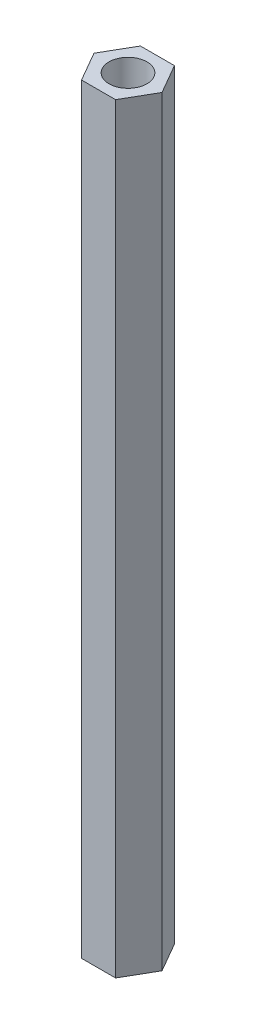
ISO-10303-21;
HEADER;
FILE_DESCRIPTION(('STEP AP214'),'2;1');
FILE_NAME('part.step','',(''),(''),'','','');
FILE_SCHEMA(('AUTOMOTIVE_DESIGN { 1 0 10303 214 1 1 1 1 }'));
ENDSEC;
DATA;
#1=APPLICATION_CONTEXT('core data for automotive mechanical design processes');
#2=APPLICATION_PROTOCOL_DEFINITION('international standard','automotive_design',2000,#1);
#3=PRODUCT_CONTEXT('',#1,'mechanical');
#4=PRODUCT('Part','Part','',(#3));
#5=PRODUCT_RELATED_PRODUCT_CATEGORY('part','',(#4));
#6=PRODUCT_DEFINITION_FORMATION('','',#4);
#7=PRODUCT_DEFINITION_CONTEXT('part definition',#1,'design');
#8=PRODUCT_DEFINITION('design','',#6,#7);
#9=PRODUCT_DEFINITION_SHAPE('','',#8);
#10=(LENGTH_UNIT() NAMED_UNIT(*) SI_UNIT(.MILLI.,.METRE.));
#11=(NAMED_UNIT(*) PLANE_ANGLE_UNIT() SI_UNIT($,.RADIAN.));
#12=(NAMED_UNIT(*) SI_UNIT($,.STERADIAN.) SOLID_ANGLE_UNIT());
#13=UNCERTAINTY_MEASURE_WITH_UNIT(LENGTH_MEASURE(1.E-05),#10,'distance_accuracy_value','');
#14=(GEOMETRIC_REPRESENTATION_CONTEXT(3) GLOBAL_UNCERTAINTY_ASSIGNED_CONTEXT((#13)) GLOBAL_UNIT_ASSIGNED_CONTEXT((#10,
#11,#12)) REPRESENTATION_CONTEXT('',''));
#15=CARTESIAN_POINT('',(0.,0.,0.));
#16=DIRECTION('',(0.,0.,1.));
#17=DIRECTION('',(1.,0.,0.));
#18=AXIS2_PLACEMENT_3D('',#15,#16,#17);
#19=CARTESIAN_POINT('',(0.,60.,0.));
#20=DIRECTION('',(0.,-1.,0.));
#21=DIRECTION('',(0.,0.,-1.));
#22=AXIS2_PLACEMENT_3D('',#19,#20,#21);
#23=PLANE('',#22);
#24=DIRECTION('',(-0.5,0.,0.866025403784439));
#25=VECTOR('',#24,1.);
#26=CARTESIAN_POINT('',(-2.68275799921944,60.,-1.11130722679764E-13));
#27=LINE('',#26,#25);
#28=CARTESIAN_POINT('',(-1.34137899960966,60.,-2.32333657953018));
#29=VERTEX_POINT('',#28);
#30=CARTESIAN_POINT('',(-2.68275799921944,60.,-1.11130722679764E-13));
#31=VERTEX_POINT('',#30);
#32=EDGE_CURVE('E132',#29,#31,#27,.T.);
#33=ORIENTED_EDGE('',*,*,#32,.T.);
#34=DIRECTION('',(0.5,0.,0.866025403784438));
#35=VECTOR('',#34,1.);
#36=CARTESIAN_POINT('',(-1.34137899960965,60.,2.32333657952995));
#37=LINE('',#36,#35);
#38=CARTESIAN_POINT('',(-1.34137899960965,60.,2.32333657952995));
#39=VERTEX_POINT('',#38);
#40=EDGE_CURVE('E90',#31,#39,#37,.T.);
#41=ORIENTED_EDGE('',*,*,#40,.T.);
#42=DIRECTION('',(1.,0.,0.));
#43=VECTOR('',#42,1.);
#44=CARTESIAN_POINT('',(1.34137899960992,60.,2.32333657952995));
#45=LINE('',#44,#43);
#46=CARTESIAN_POINT('',(1.34137899960992,60.,2.32333657952995));
#47=VERTEX_POINT('',#46);
#48=EDGE_CURVE('E103',#39,#47,#45,.T.);
#49=ORIENTED_EDGE('',*,*,#48,.T.);
#50=DIRECTION('',(0.5,0.,-0.866025403784439));
#51=VECTOR('',#50,1.);
#52=CARTESIAN_POINT('',(2.68275799921971,60.,-1.13299127024735E-13));
#53=LINE('',#52,#51);
#54=CARTESIAN_POINT('',(2.68275799921971,60.,-1.13299127024735E-13));
#55=VERTEX_POINT('',#54);
#56=EDGE_CURVE('E97',#47,#55,#53,.T.);
#57=ORIENTED_EDGE('',*,*,#56,.T.);
#58=DIRECTION('',(-0.5,0.,-0.866025403784439));
#59=VECTOR('',#58,1.);
#60=CARTESIAN_POINT('',(1.34137899960992,60.,-2.32333657953018));
#61=LINE('',#60,#59);
#62=CARTESIAN_POINT('',(1.34137899960992,60.,-2.32333657953018));
#63=VERTEX_POINT('',#62);
#64=EDGE_CURVE('E101',#55,#63,#61,.T.);
#65=ORIENTED_EDGE('',*,*,#64,.T.);
#66=DIRECTION('',(-1.,0.,0.));
#67=VECTOR('',#66,1.);
#68=CARTESIAN_POINT('',(-1.34137899960966,60.,-2.32333657953018));
#69=LINE('',#68,#67);
#70=EDGE_CURVE('E53',#63,#29,#69,.T.);
#71=ORIENTED_EDGE('',*,*,#70,.T.);
#72=EDGE_LOOP('',(#33,#41,#49,#57,#65,#71));
#73=FACE_BOUND('',#72,.T.);
#74=CARTESIAN_POINT('',(0.,60.,0.));
#75=DIRECTION('',(0.,1.,0.));
#76=DIRECTION('',(0.,0.,1.));
#77=AXIS2_PLACEMENT_3D('',#74,#75,#76);
#78=CIRCLE('',#77,1.5);
#79=CARTESIAN_POINT('',(0.,60.,1.5));
#80=VERTEX_POINT('',#79);
#81=EDGE_CURVE('E125',#80,#80,#78,.T.);
#82=ORIENTED_EDGE('',*,*,#81,.F.);
#83=EDGE_LOOP('',(#82));
#84=FACE_BOUND('',#83,.T.);
#85=ADVANCED_FACE('F36',(#73,#84),#23,.F.);
#86=CARTESIAN_POINT('',(0.,0.,0.));
#87=DIRECTION('',(0.,-1.,0.));
#88=DIRECTION('',(0.,0.,-1.));
#89=AXIS2_PLACEMENT_3D('',#86,#87,#88);
#90=PLANE('',#89);
#91=DIRECTION('',(-0.5,0.,0.866025403784439));
#92=VECTOR('',#91,1.);
#93=CARTESIAN_POINT('',(-2.68275799921944,0.,-1.11130722679764E-13));
#94=LINE('',#93,#92);
#95=CARTESIAN_POINT('',(-1.34137899960966,0.,-2.32333657953018));
#96=VERTEX_POINT('',#95);
#97=CARTESIAN_POINT('',(-2.68275799921944,0.,-1.11130722679764E-13));
#98=VERTEX_POINT('',#97);
#99=EDGE_CURVE('E121',#96,#98,#94,.T.);
#100=ORIENTED_EDGE('',*,*,#99,.F.);
#101=DIRECTION('',(-1.,0.,0.));
#102=VECTOR('',#101,1.);
#103=CARTESIAN_POINT('',(-1.34137899960966,0.,-2.32333657953018));
#104=LINE('',#103,#102);
#105=CARTESIAN_POINT('',(1.34137899960992,0.,-2.32333657953018));
#106=VERTEX_POINT('',#105);
#107=EDGE_CURVE('E82',#106,#96,#104,.T.);
#108=ORIENTED_EDGE('',*,*,#107,.F.);
#109=DIRECTION('',(-0.5,0.,-0.866025403784439));
#110=VECTOR('',#109,1.);
#111=CARTESIAN_POINT('',(1.34137899960992,0.,-2.32333657953018));
#112=LINE('',#111,#110);
#113=CARTESIAN_POINT('',(2.68275799921971,0.,-1.13299127024735E-13));
#114=VERTEX_POINT('',#113);
#115=EDGE_CURVE('E76',#114,#106,#112,.T.);
#116=ORIENTED_EDGE('',*,*,#115,.F.);
#117=DIRECTION('',(0.5,0.,-0.866025403784439));
#118=VECTOR('',#117,1.);
#119=CARTESIAN_POINT('',(2.68275799921971,0.,-1.13299127024735E-13));
#120=LINE('',#119,#118);
#121=CARTESIAN_POINT('',(1.34137899960992,0.,2.32333657952995));
#122=VERTEX_POINT('',#121);
#123=EDGE_CURVE('E111',#122,#114,#120,.T.);
#124=ORIENTED_EDGE('',*,*,#123,.F.);
#125=DIRECTION('',(1.,0.,0.));
#126=VECTOR('',#125,1.);
#127=CARTESIAN_POINT('',(1.34137899960992,0.,2.32333657952995));
#128=LINE('',#127,#126);
#129=CARTESIAN_POINT('',(-1.34137899960965,0.,2.32333657952995));
#130=VERTEX_POINT('',#129);
#131=EDGE_CURVE('E127',#130,#122,#128,.T.);
#132=ORIENTED_EDGE('',*,*,#131,.F.);
#133=DIRECTION('',(0.5,0.,0.866025403784438));
#134=VECTOR('',#133,1.);
#135=CARTESIAN_POINT('',(-1.34137899960965,0.,2.32333657952995));
#136=LINE('',#135,#134);
#137=EDGE_CURVE('E124',#98,#130,#136,.T.);
#138=ORIENTED_EDGE('',*,*,#137,.F.);
#139=EDGE_LOOP('',(#100,#108,#116,#124,#132,#138));
#140=FACE_BOUND('',#139,.T.);
#141=CARTESIAN_POINT('',(0.,0.,0.));
#142=DIRECTION('',(0.,1.,0.));
#143=DIRECTION('',(0.,0.,1.));
#144=AXIS2_PLACEMENT_3D('',#141,#142,#143);
#145=CIRCLE('',#144,1.5);
#146=CARTESIAN_POINT('',(0.,0.,1.5));
#147=VERTEX_POINT('',#146);
#148=EDGE_CURVE('E225',#147,#147,#145,.T.);
#149=ORIENTED_EDGE('',*,*,#148,.T.);
#150=EDGE_LOOP('',(#149));
#151=FACE_BOUND('',#150,.T.);
#152=ADVANCED_FACE('F141',(#140,#151),#90,.T.);
#153=CARTESIAN_POINT('',(-2.68275799921944,60.,-1.11130722679764E-13));
#154=DIRECTION('',(0.866025403784439,0.,0.5));
#155=DIRECTION('',(0.5,0.,-0.866025403784439));
#156=AXIS2_PLACEMENT_3D('',#153,#154,#155);
#157=PLANE('',#156);
#158=ORIENTED_EDGE('',*,*,#99,.T.);
#159=DIRECTION('',(0.,-1.,0.));
#160=VECTOR('',#159,1.);
#161=CARTESIAN_POINT('',(-2.68275799921944,60.,-1.11130722679764E-13));
#162=LINE('',#161,#160);
#163=EDGE_CURVE('E11',#31,#98,#162,.T.);
#164=ORIENTED_EDGE('',*,*,#163,.F.);
#165=ORIENTED_EDGE('',*,*,#32,.F.);
#166=DIRECTION('',(0.,-1.,0.));
#167=VECTOR('',#166,1.);
#168=CARTESIAN_POINT('',(-1.34137899960966,60.,-2.32333657953018));
#169=LINE('',#168,#167);
#170=EDGE_CURVE('E117',#29,#96,#169,.T.);
#171=ORIENTED_EDGE('',*,*,#170,.T.);
#172=EDGE_LOOP('',(#158,#164,#165,#171));
#173=FACE_BOUND('',#172,.T.);
#174=ADVANCED_FACE('F38',(#173),#157,.F.);
#175=CARTESIAN_POINT('',(-1.34137899960965,60.,2.32333657952995));
#176=DIRECTION('',(0.866025403784438,0.,-0.5));
#177=DIRECTION('',(-0.5,0.,-0.866025403784438));
#178=AXIS2_PLACEMENT_3D('',#175,#176,#177);
#179=PLANE('',#178);
#180=ORIENTED_EDGE('',*,*,#137,.T.);
#181=DIRECTION('',(0.,-1.,0.));
#182=VECTOR('',#181,1.);
#183=CARTESIAN_POINT('',(-1.34137899960965,60.,2.32333657952995));
#184=LINE('',#183,#182);
#185=EDGE_CURVE('E45',#39,#130,#184,.T.);
#186=ORIENTED_EDGE('',*,*,#185,.F.);
#187=ORIENTED_EDGE('',*,*,#40,.F.);
#188=ORIENTED_EDGE('',*,*,#163,.T.);
#189=EDGE_LOOP('',(#180,#186,#187,#188));
#190=FACE_BOUND('',#189,.T.);
#191=ADVANCED_FACE('F166',(#190),#179,.F.);
#192=CARTESIAN_POINT('',(1.34137899960992,60.,2.32333657952995));
#193=DIRECTION('',(0.,0.,-1.));
#194=DIRECTION('',(-1.,0.,0.));
#195=AXIS2_PLACEMENT_3D('',#192,#193,#194);
#196=PLANE('',#195);
#197=ORIENTED_EDGE('',*,*,#131,.T.);
#198=DIRECTION('',(0.,-1.,0.));
#199=VECTOR('',#198,1.);
#200=CARTESIAN_POINT('',(1.34137899960992,60.,2.32333657952995));
#201=LINE('',#200,#199);
#202=EDGE_CURVE('E112',#47,#122,#201,.T.);
#203=ORIENTED_EDGE('',*,*,#202,.F.);
#204=ORIENTED_EDGE('',*,*,#48,.F.);
#205=ORIENTED_EDGE('',*,*,#185,.T.);
#206=EDGE_LOOP('',(#197,#203,#204,#205));
#207=FACE_BOUND('',#206,.T.);
#208=ADVANCED_FACE('F138',(#207),#196,.F.);
#209=CARTESIAN_POINT('',(2.68275799921971,60.,-1.13299127024735E-13));
#210=DIRECTION('',(-0.866025403784439,0.,-0.5));
#211=DIRECTION('',(-0.5,0.,0.866025403784439));
#212=AXIS2_PLACEMENT_3D('',#209,#210,#211);
#213=PLANE('',#212);
#214=ORIENTED_EDGE('',*,*,#123,.T.);
#215=DIRECTION('',(0.,-1.,0.));
#216=VECTOR('',#215,1.);
#217=CARTESIAN_POINT('',(2.68275799921971,60.,-1.13299127024735E-13));
#218=LINE('',#217,#216);
#219=EDGE_CURVE('E108',#55,#114,#218,.T.);
#220=ORIENTED_EDGE('',*,*,#219,.F.);
#221=ORIENTED_EDGE('',*,*,#56,.F.);
#222=ORIENTED_EDGE('',*,*,#202,.T.);
#223=EDGE_LOOP('',(#214,#220,#221,#222));
#224=FACE_BOUND('',#223,.T.);
#225=ADVANCED_FACE('F109',(#224),#213,.F.);
#226=CARTESIAN_POINT('',(1.34137899960992,60.,-2.32333657953018));
#227=DIRECTION('',(-0.866025403784439,0.,0.5));
#228=DIRECTION('',(0.5,0.,0.866025403784439));
#229=AXIS2_PLACEMENT_3D('',#226,#227,#228);
#230=PLANE('',#229);
#231=ORIENTED_EDGE('',*,*,#115,.T.);
#232=DIRECTION('',(0.,-1.,0.));
#233=VECTOR('',#232,1.);
#234=CARTESIAN_POINT('',(1.34137899960992,60.,-2.32333657953018));
#235=LINE('',#234,#233);
#236=EDGE_CURVE('E113',#63,#106,#235,.T.);
#237=ORIENTED_EDGE('',*,*,#236,.F.);
#238=ORIENTED_EDGE('',*,*,#64,.F.);
#239=ORIENTED_EDGE('',*,*,#219,.T.);
#240=EDGE_LOOP('',(#231,#237,#238,#239));
#241=FACE_BOUND('',#240,.T.);
#242=ADVANCED_FACE('F115',(#241),#230,.F.);
#243=CARTESIAN_POINT('',(-1.34137899960966,60.,-2.32333657953018));
#244=DIRECTION('',(0.,0.,1.));
#245=DIRECTION('',(1.,0.,0.));
#246=AXIS2_PLACEMENT_3D('',#243,#244,#245);
#247=PLANE('',#246);
#248=ORIENTED_EDGE('',*,*,#107,.T.);
#249=ORIENTED_EDGE('',*,*,#170,.F.);
#250=ORIENTED_EDGE('',*,*,#70,.F.);
#251=ORIENTED_EDGE('',*,*,#236,.T.);
#252=EDGE_LOOP('',(#248,#249,#250,#251));
#253=FACE_BOUND('',#252,.T.);
#254=ADVANCED_FACE('F146',(#253),#247,.F.);
#255=CARTESIAN_POINT('',(0.,60.,0.));
#256=DIRECTION('',(0.,-1.,0.));
#257=DIRECTION('',(0.,0.,-1.));
#258=AXIS2_PLACEMENT_3D('',#255,#256,#257);
#259=CYLINDRICAL_SURFACE('',#258,1.5);
#260=ORIENTED_EDGE('',*,*,#81,.T.);
#261=EDGE_LOOP('',(#260));
#262=FACE_BOUND('',#261,.T.);
#263=ORIENTED_EDGE('',*,*,#148,.F.);
#264=EDGE_LOOP('',(#263));
#265=FACE_BOUND('',#264,.T.);
#266=ADVANCED_FACE('F148',(#262,#265),#259,.F.);
#267=CLOSED_SHELL('',(#85,#152,#174,#191,#208,#225,#242,#254,#266));
#268=MANIFOLD_SOLID_BREP('B2',#267);
#269=ADVANCED_BREP_SHAPE_REPRESENTATION('',(#18,#268),#14);
#270=SHAPE_DEFINITION_REPRESENTATION(#9,#269);
ENDSEC;
END-ISO-10303-21;
